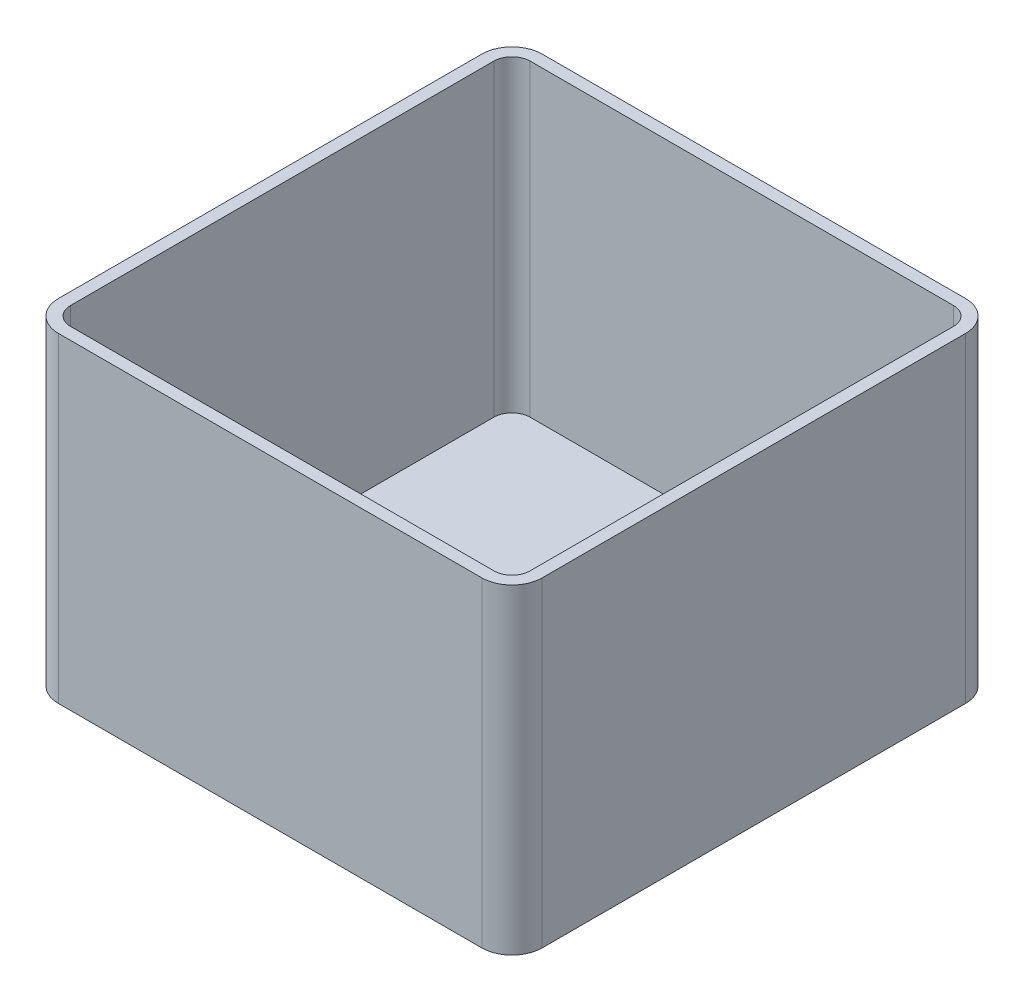
ISO-10303-21;
HEADER;
FILE_DESCRIPTION(('STEP AP214'),'2;1');
FILE_NAME('part.step','',(''),(''),'','','');
FILE_SCHEMA(('AUTOMOTIVE_DESIGN { 1 0 10303 214 1 1 1 1 }'));
ENDSEC;
DATA;
#1=APPLICATION_CONTEXT('core data for automotive mechanical design processes');
#2=APPLICATION_PROTOCOL_DEFINITION('international standard','automotive_design',2000,#1);
#3=PRODUCT_CONTEXT('',#1,'mechanical');
#4=PRODUCT('Part','Part','',(#3));
#5=PRODUCT_RELATED_PRODUCT_CATEGORY('part','',(#4));
#6=PRODUCT_DEFINITION_FORMATION('','',#4);
#7=PRODUCT_DEFINITION_CONTEXT('part definition',#1,'design');
#8=PRODUCT_DEFINITION('design','',#6,#7);
#9=PRODUCT_DEFINITION_SHAPE('','',#8);
#10=(LENGTH_UNIT() NAMED_UNIT(*) SI_UNIT(.MILLI.,.METRE.));
#11=(NAMED_UNIT(*) PLANE_ANGLE_UNIT() SI_UNIT($,.RADIAN.));
#12=(NAMED_UNIT(*) SI_UNIT($,.STERADIAN.) SOLID_ANGLE_UNIT());
#13=UNCERTAINTY_MEASURE_WITH_UNIT(LENGTH_MEASURE(1.E-05),#10,'distance_accuracy_value','');
#14=(GEOMETRIC_REPRESENTATION_CONTEXT(3) GLOBAL_UNCERTAINTY_ASSIGNED_CONTEXT((#13)) GLOBAL_UNIT_ASSIGNED_CONTEXT((#10,
#11,#12)) REPRESENTATION_CONTEXT('',''));
#15=CARTESIAN_POINT('',(0.,0.,0.));
#16=DIRECTION('',(0.,0.,1.));
#17=DIRECTION('',(1.,0.,0.));
#18=AXIS2_PLACEMENT_3D('',#15,#16,#17);
#19=CARTESIAN_POINT('',(0.,53.,-80.));
#20=DIRECTION('',(0.,-1.,0.));
#21=DIRECTION('',(0.,0.,-1.));
#22=AXIS2_PLACEMENT_3D('',#19,#20,#21);
#23=PLANE('',#22);
#24=DIRECTION('',(0.,0.,1.));
#25=VECTOR('',#24,1.);
#26=CARTESIAN_POINT('',(0.,53.,0.));
#27=LINE('',#26,#25);
#28=CARTESIAN_POINT('',(0.,53.,-75.));
#29=VERTEX_POINT('',#28);
#30=CARTESIAN_POINT('',(0.,53.,-5.));
#31=VERTEX_POINT('',#30);
#32=EDGE_CURVE('E217',#29,#31,#27,.T.);
#33=ORIENTED_EDGE('',*,*,#32,.T.);
#34=CARTESIAN_POINT('',(5.,53.,-5.));
#35=DIRECTION('',(0.,-1.,0.));
#36=DIRECTION('',(0.,0.,-1.));
#37=AXIS2_PLACEMENT_3D('',#34,#35,#36);
#38=CIRCLE('',#37,5.);
#39=CARTESIAN_POINT('',(5.,53.,0.));
#40=VERTEX_POINT('',#39);
#41=EDGE_CURVE('E262',#31,#40,#38,.F.);
#42=ORIENTED_EDGE('',*,*,#41,.T.);
#43=DIRECTION('',(1.,0.,0.));
#44=VECTOR('',#43,1.);
#45=CARTESIAN_POINT('',(0.,53.,0.));
#46=LINE('',#45,#44);
#47=CARTESIAN_POINT('',(75.,53.,0.));
#48=VERTEX_POINT('',#47);
#49=EDGE_CURVE('E220',#40,#48,#46,.T.);
#50=ORIENTED_EDGE('',*,*,#49,.T.);
#51=CARTESIAN_POINT('',(75.,53.,-5.));
#52=DIRECTION('',(0.,-1.,0.));
#53=DIRECTION('',(0.,0.,-1.));
#54=AXIS2_PLACEMENT_3D('',#51,#52,#53);
#55=CIRCLE('',#54,5.);
#56=CARTESIAN_POINT('',(80.,53.,-5.));
#57=VERTEX_POINT('',#56);
#58=EDGE_CURVE('E256',#48,#57,#55,.F.);
#59=ORIENTED_EDGE('',*,*,#58,.T.);
#60=DIRECTION('',(0.,0.,-1.));
#61=VECTOR('',#60,1.);
#62=CARTESIAN_POINT('',(80.,53.,0.));
#63=LINE('',#62,#61);
#64=CARTESIAN_POINT('',(80.,53.,-75.));
#65=VERTEX_POINT('',#64);
#66=EDGE_CURVE('E224',#57,#65,#63,.T.);
#67=ORIENTED_EDGE('',*,*,#66,.T.);
#68=CARTESIAN_POINT('',(75.,53.,-75.));
#69=DIRECTION('',(0.,-1.,0.));
#70=DIRECTION('',(0.,0.,-1.));
#71=AXIS2_PLACEMENT_3D('',#68,#69,#70);
#72=CIRCLE('',#71,5.);
#73=CARTESIAN_POINT('',(75.,53.,-80.));
#74=VERTEX_POINT('',#73);
#75=EDGE_CURVE('E258',#65,#74,#72,.F.);
#76=ORIENTED_EDGE('',*,*,#75,.T.);
#77=DIRECTION('',(-1.,0.,0.));
#78=VECTOR('',#77,1.);
#79=CARTESIAN_POINT('',(0.,53.,-80.));
#80=LINE('',#79,#78);
#81=CARTESIAN_POINT('',(4.99999999999997,53.,-80.));
#82=VERTEX_POINT('',#81);
#83=EDGE_CURVE('E227',#74,#82,#80,.T.);
#84=ORIENTED_EDGE('',*,*,#83,.T.);
#85=CARTESIAN_POINT('',(4.99999999999997,53.,-75.));
#86=DIRECTION('',(0.,-1.,0.));
#87=DIRECTION('',(0.,0.,-1.));
#88=AXIS2_PLACEMENT_3D('',#85,#86,#87);
#89=CIRCLE('',#88,5.);
#90=EDGE_CURVE('E260',#82,#29,#89,.F.);
#91=ORIENTED_EDGE('',*,*,#90,.T.);
#92=EDGE_LOOP('',(#33,#42,#50,#59,#67,#76,#84,#91));
#93=FACE_BOUND('',#92,.T.);
#94=DIRECTION('',(0.,0.,1.));
#95=VECTOR('',#94,1.);
#96=CARTESIAN_POINT('',(1.99999999999997,53.,-80.));
#97=LINE('',#96,#95);
#98=CARTESIAN_POINT('',(1.99999999999997,53.,-75.));
#99=VERTEX_POINT('',#98);
#100=CARTESIAN_POINT('',(2.,53.,-5.));
#101=VERTEX_POINT('',#100);
#102=EDGE_CURVE('E171',#99,#101,#97,.T.);
#103=ORIENTED_EDGE('',*,*,#102,.F.);
#104=CARTESIAN_POINT('',(4.99999999999997,53.,-75.));
#105=DIRECTION('',(0.,-1.,0.));
#106=DIRECTION('',(0.,0.,-1.));
#107=AXIS2_PLACEMENT_3D('',#104,#105,#106);
#108=CIRCLE('',#107,3.);
#109=CARTESIAN_POINT('',(4.99999999999997,53.,-78.));
#110=VERTEX_POINT('',#109);
#111=EDGE_CURVE('E208',#110,#99,#108,.F.);
#112=ORIENTED_EDGE('',*,*,#111,.F.);
#113=DIRECTION('',(-1.,0.,0.));
#114=VECTOR('',#113,1.);
#115=CARTESIAN_POINT('',(0.,53.,-78.));
#116=LINE('',#115,#114);
#117=CARTESIAN_POINT('',(75.,53.,-78.));
#118=VERTEX_POINT('',#117);
#119=EDGE_CURVE('E46',#118,#110,#116,.T.);
#120=ORIENTED_EDGE('',*,*,#119,.F.);
#121=CARTESIAN_POINT('',(75.,53.,-75.));
#122=DIRECTION('',(0.,-1.,0.));
#123=DIRECTION('',(0.,0.,-1.));
#124=AXIS2_PLACEMENT_3D('',#121,#122,#123);
#125=CIRCLE('',#124,3.);
#126=CARTESIAN_POINT('',(78.,53.,-75.));
#127=VERTEX_POINT('',#126);
#128=EDGE_CURVE('E175',#127,#118,#125,.F.);
#129=ORIENTED_EDGE('',*,*,#128,.F.);
#130=DIRECTION('',(0.,0.,-1.));
#131=VECTOR('',#130,1.);
#132=CARTESIAN_POINT('',(78.,53.,-80.));
#133=LINE('',#132,#131);
#134=CARTESIAN_POINT('',(78.,53.,-5.));
#135=VERTEX_POINT('',#134);
#136=EDGE_CURVE('E210',#135,#127,#133,.T.);
#137=ORIENTED_EDGE('',*,*,#136,.F.);
#138=CARTESIAN_POINT('',(75.,53.,-5.));
#139=DIRECTION('',(0.,-1.,0.));
#140=DIRECTION('',(0.,0.,-1.));
#141=AXIS2_PLACEMENT_3D('',#138,#139,#140);
#142=CIRCLE('',#141,3.);
#143=CARTESIAN_POINT('',(75.,53.,-2.));
#144=VERTEX_POINT('',#143);
#145=EDGE_CURVE('E173',#144,#135,#142,.F.);
#146=ORIENTED_EDGE('',*,*,#145,.F.);
#147=DIRECTION('',(1.,0.,0.));
#148=VECTOR('',#147,1.);
#149=CARTESIAN_POINT('',(0.,53.,-2.));
#150=LINE('',#149,#148);
#151=CARTESIAN_POINT('',(5.,53.,-2.));
#152=VERTEX_POINT('',#151);
#153=EDGE_CURVE('E206',#152,#144,#150,.T.);
#154=ORIENTED_EDGE('',*,*,#153,.F.);
#155=CARTESIAN_POINT('',(5.,53.,-5.));
#156=DIRECTION('',(0.,-1.,0.));
#157=DIRECTION('',(0.,0.,-1.));
#158=AXIS2_PLACEMENT_3D('',#155,#156,#157);
#159=CIRCLE('',#158,3.);
#160=EDGE_CURVE('E203',#101,#152,#159,.F.);
#161=ORIENTED_EDGE('',*,*,#160,.F.);
#162=EDGE_LOOP('',(#103,#112,#120,#129,#137,#146,#154,#161));
#163=FACE_BOUND('',#162,.T.);
#164=ADVANCED_FACE('F31',(#93,#163),#23,.F.);
#165=CARTESIAN_POINT('',(0.,53.,0.));
#166=DIRECTION('',(1.,0.,0.));
#167=DIRECTION('',(0.,0.,-1.));
#168=AXIS2_PLACEMENT_3D('',#165,#166,#167);
#169=PLANE('',#168);
#170=DIRECTION('',(0.,0.,1.));
#171=VECTOR('',#170,1.);
#172=CARTESIAN_POINT('',(0.,0.,0.));
#173=LINE('',#172,#171);
#174=CARTESIAN_POINT('',(0.,0.,-75.));
#175=VERTEX_POINT('',#174);
#176=CARTESIAN_POINT('',(0.,0.,-5.));
#177=VERTEX_POINT('',#176);
#178=EDGE_CURVE('E199',#175,#177,#173,.T.);
#179=ORIENTED_EDGE('',*,*,#178,.T.);
#180=DIRECTION('',(0.,-1.,0.));
#181=VECTOR('',#180,1.);
#182=CARTESIAN_POINT('',(0.,53.,-5.));
#183=LINE('',#182,#181);
#184=EDGE_CURVE('E254',#177,#31,#183,.F.);
#185=ORIENTED_EDGE('',*,*,#184,.T.);
#186=ORIENTED_EDGE('',*,*,#32,.F.);
#187=DIRECTION('',(0.,-1.,0.));
#188=VECTOR('',#187,1.);
#189=CARTESIAN_POINT('',(0.,53.,-75.));
#190=LINE('',#189,#188);
#191=EDGE_CURVE('E251',#29,#175,#190,.T.);
#192=ORIENTED_EDGE('',*,*,#191,.T.);
#193=EDGE_LOOP('',(#179,#185,#186,#192));
#194=FACE_BOUND('',#193,.T.);
#195=ADVANCED_FACE('F294',(#194),#169,.F.);
#196=CARTESIAN_POINT('',(0.,53.,0.));
#197=DIRECTION('',(0.,0.,-1.));
#198=DIRECTION('',(-1.,0.,0.));
#199=AXIS2_PLACEMENT_3D('',#196,#197,#198);
#200=PLANE('',#199);
#201=ORIENTED_EDGE('',*,*,#49,.F.);
#202=DIRECTION('',(0.,-1.,0.));
#203=VECTOR('',#202,1.);
#204=CARTESIAN_POINT('',(5.,53.,0.));
#205=LINE('',#204,#203);
#206=CARTESIAN_POINT('',(5.,0.,0.));
#207=VERTEX_POINT('',#206);
#208=EDGE_CURVE('E240',#40,#207,#205,.T.);
#209=ORIENTED_EDGE('',*,*,#208,.T.);
#210=DIRECTION('',(1.,0.,0.));
#211=VECTOR('',#210,1.);
#212=CARTESIAN_POINT('',(0.,0.,0.));
#213=LINE('',#212,#211);
#214=CARTESIAN_POINT('',(75.,0.,0.));
#215=VERTEX_POINT('',#214);
#216=EDGE_CURVE('E232',#207,#215,#213,.T.);
#217=ORIENTED_EDGE('',*,*,#216,.T.);
#218=DIRECTION('',(0.,-1.,0.));
#219=VECTOR('',#218,1.);
#220=CARTESIAN_POINT('',(75.,53.,0.));
#221=LINE('',#220,#219);
#222=EDGE_CURVE('E229',#215,#48,#221,.F.);
#223=ORIENTED_EDGE('',*,*,#222,.T.);
#224=EDGE_LOOP('',(#201,#209,#217,#223));
#225=FACE_BOUND('',#224,.T.);
#226=ADVANCED_FACE('F302',(#225),#200,.F.);
#227=CARTESIAN_POINT('',(80.,53.,0.));
#228=DIRECTION('',(-1.,0.,0.));
#229=DIRECTION('',(0.,0.,1.));
#230=AXIS2_PLACEMENT_3D('',#227,#228,#229);
#231=PLANE('',#230);
#232=DIRECTION('',(0.,0.,-1.));
#233=VECTOR('',#232,1.);
#234=CARTESIAN_POINT('',(80.,0.,0.));
#235=LINE('',#234,#233);
#236=CARTESIAN_POINT('',(80.,0.,-5.));
#237=VERTEX_POINT('',#236);
#238=CARTESIAN_POINT('',(80.,0.,-75.));
#239=VERTEX_POINT('',#238);
#240=EDGE_CURVE('E235',#237,#239,#235,.T.);
#241=ORIENTED_EDGE('',*,*,#240,.T.);
#242=DIRECTION('',(0.,-1.,0.));
#243=VECTOR('',#242,1.);
#244=CARTESIAN_POINT('',(80.,53.,-75.));
#245=LINE('',#244,#243);
#246=EDGE_CURVE('E11',#239,#65,#245,.F.);
#247=ORIENTED_EDGE('',*,*,#246,.T.);
#248=ORIENTED_EDGE('',*,*,#66,.F.);
#249=DIRECTION('',(0.,-1.,0.));
#250=VECTOR('',#249,1.);
#251=CARTESIAN_POINT('',(80.,53.,-5.));
#252=LINE('',#251,#250);
#253=EDGE_CURVE('E39',#57,#237,#252,.T.);
#254=ORIENTED_EDGE('',*,*,#253,.T.);
#255=EDGE_LOOP('',(#241,#247,#248,#254));
#256=FACE_BOUND('',#255,.T.);
#257=ADVANCED_FACE('F272',(#256),#231,.F.);
#258=CARTESIAN_POINT('',(0.,53.,-80.));
#259=DIRECTION('',(0.,0.,1.));
#260=DIRECTION('',(1.,0.,0.));
#261=AXIS2_PLACEMENT_3D('',#258,#259,#260);
#262=PLANE('',#261);
#263=DIRECTION('',(-1.,0.,0.));
#264=VECTOR('',#263,1.);
#265=CARTESIAN_POINT('',(0.,0.,-80.));
#266=LINE('',#265,#264);
#267=CARTESIAN_POINT('',(75.,0.,-80.));
#268=VERTEX_POINT('',#267);
#269=CARTESIAN_POINT('',(4.99999999999997,0.,-80.));
#270=VERTEX_POINT('',#269);
#271=EDGE_CURVE('E221',#268,#270,#266,.T.);
#272=ORIENTED_EDGE('',*,*,#271,.T.);
#273=DIRECTION('',(0.,-1.,0.));
#274=VECTOR('',#273,1.);
#275=CARTESIAN_POINT('',(4.99999999999997,53.,-80.));
#276=LINE('',#275,#274);
#277=EDGE_CURVE('E54',#270,#82,#276,.F.);
#278=ORIENTED_EDGE('',*,*,#277,.T.);
#279=ORIENTED_EDGE('',*,*,#83,.F.);
#280=DIRECTION('',(0.,-1.,0.));
#281=VECTOR('',#280,1.);
#282=CARTESIAN_POINT('',(75.,53.,-80.));
#283=LINE('',#282,#281);
#284=EDGE_CURVE('E264',#74,#268,#283,.T.);
#285=ORIENTED_EDGE('',*,*,#284,.T.);
#286=EDGE_LOOP('',(#272,#278,#279,#285));
#287=FACE_BOUND('',#286,.T.);
#288=ADVANCED_FACE('F284',(#287),#262,.F.);
#289=CARTESIAN_POINT('',(0.,0.,-80.));
#290=DIRECTION('',(0.,-1.,0.));
#291=DIRECTION('',(0.,0.,-1.));
#292=AXIS2_PLACEMENT_3D('',#289,#290,#291);
#293=PLANE('',#292);
#294=ORIENTED_EDGE('',*,*,#216,.F.);
#295=CARTESIAN_POINT('',(5.,0.,-5.));
#296=DIRECTION('',(0.,-1.,0.));
#297=DIRECTION('',(0.,0.,-1.));
#298=AXIS2_PLACEMENT_3D('',#295,#296,#297);
#299=CIRCLE('',#298,5.);
#300=EDGE_CURVE('E249',#207,#177,#299,.T.);
#301=ORIENTED_EDGE('',*,*,#300,.T.);
#302=ORIENTED_EDGE('',*,*,#178,.F.);
#303=CARTESIAN_POINT('',(4.99999999999997,0.,-75.));
#304=DIRECTION('',(0.,-1.,0.));
#305=DIRECTION('',(0.,0.,-1.));
#306=AXIS2_PLACEMENT_3D('',#303,#304,#305);
#307=CIRCLE('',#306,5.);
#308=EDGE_CURVE('E247',#175,#270,#307,.T.);
#309=ORIENTED_EDGE('',*,*,#308,.T.);
#310=ORIENTED_EDGE('',*,*,#271,.F.);
#311=CARTESIAN_POINT('',(75.,0.,-75.));
#312=DIRECTION('',(0.,-1.,0.));
#313=DIRECTION('',(0.,0.,-1.));
#314=AXIS2_PLACEMENT_3D('',#311,#312,#313);
#315=CIRCLE('',#314,5.);
#316=EDGE_CURVE('E245',#268,#239,#315,.T.);
#317=ORIENTED_EDGE('',*,*,#316,.T.);
#318=ORIENTED_EDGE('',*,*,#240,.F.);
#319=CARTESIAN_POINT('',(75.,0.,-5.));
#320=DIRECTION('',(0.,-1.,0.));
#321=DIRECTION('',(0.,0.,-1.));
#322=AXIS2_PLACEMENT_3D('',#319,#320,#321);
#323=CIRCLE('',#322,5.);
#324=EDGE_CURVE('E243',#237,#215,#323,.T.);
#325=ORIENTED_EDGE('',*,*,#324,.T.);
#326=EDGE_LOOP('',(#294,#301,#302,#309,#310,#317,#318,#325));
#327=FACE_BOUND('',#326,.T.);
#328=ADVANCED_FACE('F278',(#327),#293,.T.);
#329=CARTESIAN_POINT('',(5.,53.,-5.));
#330=DIRECTION('',(0.,-1.,0.));
#331=DIRECTION('',(0.,0.,-1.));
#332=AXIS2_PLACEMENT_3D('',#329,#330,#331);
#333=CYLINDRICAL_SURFACE('',#332,5.);
#334=ORIENTED_EDGE('',*,*,#41,.F.);
#335=ORIENTED_EDGE('',*,*,#184,.F.);
#336=ORIENTED_EDGE('',*,*,#300,.F.);
#337=ORIENTED_EDGE('',*,*,#208,.F.);
#338=EDGE_LOOP('',(#334,#335,#336,#337));
#339=FACE_BOUND('',#338,.T.);
#340=ADVANCED_FACE('F299',(#339),#333,.T.);
#341=CARTESIAN_POINT('',(4.99999999999997,53.,-75.));
#342=DIRECTION('',(0.,-1.,0.));
#343=DIRECTION('',(0.,0.,-1.));
#344=AXIS2_PLACEMENT_3D('',#341,#342,#343);
#345=CYLINDRICAL_SURFACE('',#344,5.);
#346=ORIENTED_EDGE('',*,*,#90,.F.);
#347=ORIENTED_EDGE('',*,*,#277,.F.);
#348=ORIENTED_EDGE('',*,*,#308,.F.);
#349=ORIENTED_EDGE('',*,*,#191,.F.);
#350=EDGE_LOOP('',(#346,#347,#348,#349));
#351=FACE_BOUND('',#350,.T.);
#352=ADVANCED_FACE('F291',(#351),#345,.T.);
#353=CARTESIAN_POINT('',(75.,53.,-75.));
#354=DIRECTION('',(0.,-1.,0.));
#355=DIRECTION('',(0.,0.,-1.));
#356=AXIS2_PLACEMENT_3D('',#353,#354,#355);
#357=CYLINDRICAL_SURFACE('',#356,5.);
#358=ORIENTED_EDGE('',*,*,#75,.F.);
#359=ORIENTED_EDGE('',*,*,#246,.F.);
#360=ORIENTED_EDGE('',*,*,#316,.F.);
#361=ORIENTED_EDGE('',*,*,#284,.F.);
#362=EDGE_LOOP('',(#358,#359,#360,#361));
#363=FACE_BOUND('',#362,.T.);
#364=ADVANCED_FACE('F283',(#363),#357,.T.);
#365=CARTESIAN_POINT('',(75.,53.,-5.));
#366=DIRECTION('',(0.,-1.,0.));
#367=DIRECTION('',(0.,0.,-1.));
#368=AXIS2_PLACEMENT_3D('',#365,#366,#367);
#369=CYLINDRICAL_SURFACE('',#368,5.);
#370=ORIENTED_EDGE('',*,*,#58,.F.);
#371=ORIENTED_EDGE('',*,*,#222,.F.);
#372=ORIENTED_EDGE('',*,*,#324,.F.);
#373=ORIENTED_EDGE('',*,*,#253,.F.);
#374=EDGE_LOOP('',(#370,#371,#372,#373));
#375=FACE_BOUND('',#374,.T.);
#376=ADVANCED_FACE('F33',(#375),#369,.T.);
#377=CARTESIAN_POINT('',(2.,53.,0.));
#378=DIRECTION('',(1.,0.,0.));
#379=DIRECTION('',(0.,0.,-1.));
#380=AXIS2_PLACEMENT_3D('',#377,#378,#379);
#381=PLANE('',#380);
#382=DIRECTION('',(0.,0.,1.));
#383=VECTOR('',#382,1.);
#384=CARTESIAN_POINT('',(1.99999999999997,2.,-80.));
#385=LINE('',#384,#383);
#386=CARTESIAN_POINT('',(1.99999999999997,2.,-75.));
#387=VERTEX_POINT('',#386);
#388=CARTESIAN_POINT('',(2.,2.,-5.));
#389=VERTEX_POINT('',#388);
#390=EDGE_CURVE('E161',#387,#389,#385,.T.);
#391=ORIENTED_EDGE('',*,*,#390,.F.);
#392=DIRECTION('',(0.,1.,0.));
#393=VECTOR('',#392,1.);
#394=CARTESIAN_POINT('',(1.99999999999997,53.,-75.));
#395=LINE('',#394,#393);
#396=EDGE_CURVE('E157',#99,#387,#395,.F.);
#397=ORIENTED_EDGE('',*,*,#396,.F.);
#398=ORIENTED_EDGE('',*,*,#102,.T.);
#399=DIRECTION('',(0.,1.,0.));
#400=VECTOR('',#399,1.);
#401=CARTESIAN_POINT('',(2.,53.,-5.));
#402=LINE('',#401,#400);
#403=EDGE_CURVE('E150',#389,#101,#402,.T.);
#404=ORIENTED_EDGE('',*,*,#403,.F.);
#405=EDGE_LOOP('',(#391,#397,#398,#404));
#406=FACE_BOUND('',#405,.T.);
#407=ADVANCED_FACE('F169',(#406),#381,.T.);
#408=CARTESIAN_POINT('',(0.,53.,-2.));
#409=DIRECTION('',(0.,0.,-1.));
#410=DIRECTION('',(-1.,0.,0.));
#411=AXIS2_PLACEMENT_3D('',#408,#409,#410);
#412=PLANE('',#411);
#413=ORIENTED_EDGE('',*,*,#153,.T.);
#414=DIRECTION('',(0.,1.,0.));
#415=VECTOR('',#414,1.);
#416=CARTESIAN_POINT('',(75.,53.,-2.));
#417=LINE('',#416,#415);
#418=CARTESIAN_POINT('',(75.,2.,-2.));
#419=VERTEX_POINT('',#418);
#420=EDGE_CURVE('E191',#419,#144,#417,.T.);
#421=ORIENTED_EDGE('',*,*,#420,.F.);
#422=DIRECTION('',(1.,0.,0.));
#423=VECTOR('',#422,1.);
#424=CARTESIAN_POINT('',(0.,2.,-2.));
#425=LINE('',#424,#423);
#426=CARTESIAN_POINT('',(5.,2.,-2.));
#427=VERTEX_POINT('',#426);
#428=EDGE_CURVE('E167',#427,#419,#425,.T.);
#429=ORIENTED_EDGE('',*,*,#428,.F.);
#430=DIRECTION('',(0.,1.,0.));
#431=VECTOR('',#430,1.);
#432=CARTESIAN_POINT('',(5.,53.,-2.));
#433=LINE('',#432,#431);
#434=EDGE_CURVE('E153',#152,#427,#433,.F.);
#435=ORIENTED_EDGE('',*,*,#434,.F.);
#436=EDGE_LOOP('',(#413,#421,#429,#435));
#437=FACE_BOUND('',#436,.T.);
#438=ADVANCED_FACE('F309',(#437),#412,.T.);
#439=CARTESIAN_POINT('',(78.,53.,0.));
#440=DIRECTION('',(-1.,0.,0.));
#441=DIRECTION('',(0.,0.,1.));
#442=AXIS2_PLACEMENT_3D('',#439,#440,#441);
#443=PLANE('',#442);
#444=DIRECTION('',(0.,0.,-1.));
#445=VECTOR('',#444,1.);
#446=CARTESIAN_POINT('',(78.,2.,-80.));
#447=LINE('',#446,#445);
#448=CARTESIAN_POINT('',(78.,2.,-5.));
#449=VERTEX_POINT('',#448);
#450=CARTESIAN_POINT('',(78.,2.,-75.));
#451=VERTEX_POINT('',#450);
#452=EDGE_CURVE('E179',#449,#451,#447,.T.);
#453=ORIENTED_EDGE('',*,*,#452,.F.);
#454=DIRECTION('',(0.,1.,0.));
#455=VECTOR('',#454,1.);
#456=CARTESIAN_POINT('',(78.,53.,-5.));
#457=LINE('',#456,#455);
#458=EDGE_CURVE('E193',#135,#449,#457,.F.);
#459=ORIENTED_EDGE('',*,*,#458,.F.);
#460=ORIENTED_EDGE('',*,*,#136,.T.);
#461=DIRECTION('',(0.,1.,0.));
#462=VECTOR('',#461,1.);
#463=CARTESIAN_POINT('',(78.,53.,-75.));
#464=LINE('',#463,#462);
#465=EDGE_CURVE('E196',#451,#127,#464,.T.);
#466=ORIENTED_EDGE('',*,*,#465,.F.);
#467=EDGE_LOOP('',(#453,#459,#460,#466));
#468=FACE_BOUND('',#467,.T.);
#469=ADVANCED_FACE('F363',(#468),#443,.T.);
#470=CARTESIAN_POINT('',(0.,53.,-78.));
#471=DIRECTION('',(0.,0.,1.));
#472=DIRECTION('',(1.,0.,0.));
#473=AXIS2_PLACEMENT_3D('',#470,#471,#472);
#474=PLANE('',#473);
#475=DIRECTION('',(-1.,0.,0.));
#476=VECTOR('',#475,1.);
#477=CARTESIAN_POINT('',(0.,2.,-78.));
#478=LINE('',#477,#476);
#479=CARTESIAN_POINT('',(75.,2.,-78.));
#480=VERTEX_POINT('',#479);
#481=CARTESIAN_POINT('',(4.99999999999997,2.,-78.));
#482=VERTEX_POINT('',#481);
#483=EDGE_CURVE('E183',#480,#482,#478,.T.);
#484=ORIENTED_EDGE('',*,*,#483,.F.);
#485=DIRECTION('',(0.,1.,0.));
#486=VECTOR('',#485,1.);
#487=CARTESIAN_POINT('',(75.,53.,-78.));
#488=LINE('',#487,#486);
#489=EDGE_CURVE('E200',#118,#480,#488,.F.);
#490=ORIENTED_EDGE('',*,*,#489,.F.);
#491=ORIENTED_EDGE('',*,*,#119,.T.);
#492=DIRECTION('',(0.,1.,0.));
#493=VECTOR('',#492,1.);
#494=CARTESIAN_POINT('',(4.99999999999997,53.,-78.));
#495=LINE('',#494,#493);
#496=EDGE_CURVE('E197',#482,#110,#495,.T.);
#497=ORIENTED_EDGE('',*,*,#496,.F.);
#498=EDGE_LOOP('',(#484,#490,#491,#497));
#499=FACE_BOUND('',#498,.T.);
#500=ADVANCED_FACE('F373',(#499),#474,.T.);
#501=CARTESIAN_POINT('',(0.,2.,-80.));
#502=DIRECTION('',(0.,-1.,0.));
#503=DIRECTION('',(0.,0.,-1.));
#504=AXIS2_PLACEMENT_3D('',#501,#502,#503);
#505=PLANE('',#504);
#506=ORIENTED_EDGE('',*,*,#428,.T.);
#507=CARTESIAN_POINT('',(75.,2.,-5.));
#508=DIRECTION('',(0.,-1.,0.));
#509=DIRECTION('',(0.,0.,-1.));
#510=AXIS2_PLACEMENT_3D('',#507,#508,#509);
#511=CIRCLE('',#510,3.);
#512=EDGE_CURVE('E186',#449,#419,#511,.T.);
#513=ORIENTED_EDGE('',*,*,#512,.F.);
#514=ORIENTED_EDGE('',*,*,#452,.T.);
#515=CARTESIAN_POINT('',(75.,2.,-75.));
#516=DIRECTION('',(0.,-1.,0.));
#517=DIRECTION('',(0.,0.,-1.));
#518=AXIS2_PLACEMENT_3D('',#515,#516,#517);
#519=CIRCLE('',#518,3.);
#520=EDGE_CURVE('E182',#480,#451,#519,.T.);
#521=ORIENTED_EDGE('',*,*,#520,.F.);
#522=ORIENTED_EDGE('',*,*,#483,.T.);
#523=CARTESIAN_POINT('',(4.99999999999997,2.,-75.));
#524=DIRECTION('',(0.,-1.,0.));
#525=DIRECTION('',(0.,0.,-1.));
#526=AXIS2_PLACEMENT_3D('',#523,#524,#525);
#527=CIRCLE('',#526,3.);
#528=EDGE_CURVE('E158',#387,#482,#527,.T.);
#529=ORIENTED_EDGE('',*,*,#528,.F.);
#530=ORIENTED_EDGE('',*,*,#390,.T.);
#531=CARTESIAN_POINT('',(5.,2.,-5.));
#532=DIRECTION('',(0.,-1.,0.));
#533=DIRECTION('',(0.,0.,-1.));
#534=AXIS2_PLACEMENT_3D('',#531,#532,#533);
#535=CIRCLE('',#534,3.);
#536=EDGE_CURVE('E146',#427,#389,#535,.T.);
#537=ORIENTED_EDGE('',*,*,#536,.F.);
#538=EDGE_LOOP('',(#506,#513,#514,#521,#522,#529,#530,#537));
#539=FACE_BOUND('',#538,.T.);
#540=ADVANCED_FACE('F162',(#539),#505,.F.);
#541=CARTESIAN_POINT('',(5.,53.,-5.));
#542=DIRECTION('',(0.,-1.,0.));
#543=DIRECTION('',(0.,0.,-1.));
#544=AXIS2_PLACEMENT_3D('',#541,#542,#543);
#545=CYLINDRICAL_SURFACE('',#544,3.);
#546=ORIENTED_EDGE('',*,*,#160,.T.);
#547=ORIENTED_EDGE('',*,*,#434,.T.);
#548=ORIENTED_EDGE('',*,*,#536,.T.);
#549=ORIENTED_EDGE('',*,*,#403,.T.);
#550=EDGE_LOOP('',(#546,#547,#548,#549));
#551=FACE_BOUND('',#550,.T.);
#552=ADVANCED_FACE('F148',(#551),#545,.F.);
#553=CARTESIAN_POINT('',(4.99999999999997,53.,-75.));
#554=DIRECTION('',(0.,-1.,0.));
#555=DIRECTION('',(0.,0.,-1.));
#556=AXIS2_PLACEMENT_3D('',#553,#554,#555);
#557=CYLINDRICAL_SURFACE('',#556,3.);
#558=ORIENTED_EDGE('',*,*,#111,.T.);
#559=ORIENTED_EDGE('',*,*,#396,.T.);
#560=ORIENTED_EDGE('',*,*,#528,.T.);
#561=ORIENTED_EDGE('',*,*,#496,.T.);
#562=EDGE_LOOP('',(#558,#559,#560,#561));
#563=FACE_BOUND('',#562,.T.);
#564=ADVANCED_FACE('F399',(#563),#557,.F.);
#565=CARTESIAN_POINT('',(75.,53.,-75.));
#566=DIRECTION('',(0.,-1.,0.));
#567=DIRECTION('',(0.,0.,-1.));
#568=AXIS2_PLACEMENT_3D('',#565,#566,#567);
#569=CYLINDRICAL_SURFACE('',#568,3.);
#570=ORIENTED_EDGE('',*,*,#128,.T.);
#571=ORIENTED_EDGE('',*,*,#489,.T.);
#572=ORIENTED_EDGE('',*,*,#520,.T.);
#573=ORIENTED_EDGE('',*,*,#465,.T.);
#574=EDGE_LOOP('',(#570,#571,#572,#573));
#575=FACE_BOUND('',#574,.T.);
#576=ADVANCED_FACE('F408',(#575),#569,.F.);
#577=CARTESIAN_POINT('',(75.,53.,-5.));
#578=DIRECTION('',(0.,-1.,0.));
#579=DIRECTION('',(0.,0.,-1.));
#580=AXIS2_PLACEMENT_3D('',#577,#578,#579);
#581=CYLINDRICAL_SURFACE('',#580,3.);
#582=ORIENTED_EDGE('',*,*,#145,.T.);
#583=ORIENTED_EDGE('',*,*,#458,.T.);
#584=ORIENTED_EDGE('',*,*,#512,.T.);
#585=ORIENTED_EDGE('',*,*,#420,.T.);
#586=EDGE_LOOP('',(#582,#583,#584,#585));
#587=FACE_BOUND('',#586,.T.);
#588=ADVANCED_FACE('F319',(#587),#581,.F.);
#589=CLOSED_SHELL('',(#164,#195,#226,#257,#288,#328,#340,#352,#364,#376,#407,#438,#469,#500,
#540,#552,#564,#576,#588));
#590=MANIFOLD_SOLID_BREP('B2',#589);
#591=ADVANCED_BREP_SHAPE_REPRESENTATION('',(#18,#590),#14);
#592=SHAPE_DEFINITION_REPRESENTATION(#9,#591);
ENDSEC;
END-ISO-10303-21;
